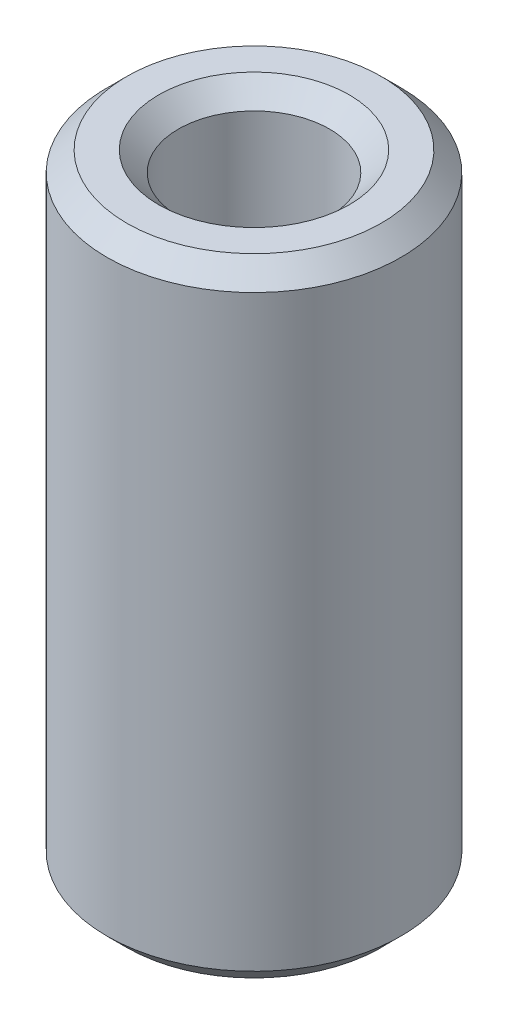
ISO-10303-21;
HEADER;
FILE_DESCRIPTION(('STEP AP214'),'2;1');
FILE_NAME('part.step','',(''),(''),'','','');
FILE_SCHEMA(('AUTOMOTIVE_DESIGN { 1 0 10303 214 1 1 1 1 }'));
ENDSEC;
DATA;
#1=APPLICATION_CONTEXT('core data for automotive mechanical design processes');
#2=APPLICATION_PROTOCOL_DEFINITION('international standard','automotive_design',2000,#1);
#3=PRODUCT_CONTEXT('',#1,'mechanical');
#4=PRODUCT('Part','Part','',(#3));
#5=PRODUCT_RELATED_PRODUCT_CATEGORY('part','',(#4));
#6=PRODUCT_DEFINITION_FORMATION('','',#4);
#7=PRODUCT_DEFINITION_CONTEXT('part definition',#1,'design');
#8=PRODUCT_DEFINITION('design','',#6,#7);
#9=PRODUCT_DEFINITION_SHAPE('','',#8);
#10=(LENGTH_UNIT() NAMED_UNIT(*) SI_UNIT(.MILLI.,.METRE.));
#11=(NAMED_UNIT(*) PLANE_ANGLE_UNIT() SI_UNIT($,.RADIAN.));
#12=(NAMED_UNIT(*) SI_UNIT($,.STERADIAN.) SOLID_ANGLE_UNIT());
#13=UNCERTAINTY_MEASURE_WITH_UNIT(LENGTH_MEASURE(1.E-05),#10,'distance_accuracy_value','');
#14=(GEOMETRIC_REPRESENTATION_CONTEXT(3) GLOBAL_UNCERTAINTY_ASSIGNED_CONTEXT((#13)) GLOBAL_UNIT_ASSIGNED_CONTEXT((#10,
#11,#12)) REPRESENTATION_CONTEXT('',''));
#15=CARTESIAN_POINT('',(0.,0.,0.));
#16=DIRECTION('',(0.,0.,1.));
#17=DIRECTION('',(1.,0.,0.));
#18=AXIS2_PLACEMENT_3D('',#15,#16,#17);
#19=CARTESIAN_POINT('',(0.,42.6871000319356,0.));
#20=DIRECTION('',(0.,-1.,0.));
#21=DIRECTION('',(0.,0.,-1.));
#22=AXIS2_PLACEMENT_3D('',#19,#20,#21);
#23=CYLINDRICAL_SURFACE('',#22,10.);
#24=CARTESIAN_POINT('',(0.,1.34265509033225,0.));
#25=DIRECTION('',(0.,1.,0.));
#26=DIRECTION('',(0.,0.,1.));
#27=AXIS2_PLACEMENT_3D('',#24,#25,#26);
#28=CIRCLE('',#27,10.);
#29=CARTESIAN_POINT('',(0.,1.34265509033225,10.));
#30=VERTEX_POINT('',#29);
#31=EDGE_CURVE('E10',#30,#30,#28,.T.);
#32=ORIENTED_EDGE('',*,*,#31,.T.);
#33=EDGE_LOOP('',(#32));
#34=FACE_BOUND('',#33,.T.);
#35=CARTESIAN_POINT('',(0.,41.3444449416034,0.));
#36=DIRECTION('',(0.,1.,0.));
#37=DIRECTION('',(0.,0.,1.));
#38=AXIS2_PLACEMENT_3D('',#35,#36,#37);
#39=CIRCLE('',#38,10.);
#40=CARTESIAN_POINT('',(0.,41.3444449416034,10.));
#41=VERTEX_POINT('',#40);
#42=EDGE_CURVE('E50',#41,#41,#39,.F.);
#43=ORIENTED_EDGE('',*,*,#42,.T.);
#44=EDGE_LOOP('',(#43));
#45=FACE_BOUND('',#44,.T.);
#46=ADVANCED_FACE('F39',(#34,#45),#23,.T.);
#47=CARTESIAN_POINT('',(0.,42.6871000319356,0.));
#48=DIRECTION('',(0.,1.,0.));
#49=DIRECTION('',(0.,0.,1.));
#50=AXIS2_PLACEMENT_3D('',#47,#48,#49);
#51=PLANE('',#50);
#52=CARTESIAN_POINT('',(0.,42.6871000319356,0.));
#53=DIRECTION('',(0.,1.,0.));
#54=DIRECTION('',(0.,0.,1.));
#55=AXIS2_PLACEMENT_3D('',#52,#53,#54);
#56=CIRCLE('',#55,6.48401903454802);
#57=CARTESIAN_POINT('',(0.,42.6871000319356,6.48401903454802));
#58=VERTEX_POINT('',#57);
#59=EDGE_CURVE('E58',#58,#58,#56,.F.);
#60=ORIENTED_EDGE('',*,*,#59,.T.);
#61=EDGE_LOOP('',(#60));
#62=FACE_BOUND('',#61,.T.);
#63=CARTESIAN_POINT('',(0.,42.6871000319356,0.));
#64=DIRECTION('',(0.,1.,0.));
#65=DIRECTION('',(0.,0.,1.));
#66=AXIS2_PLACEMENT_3D('',#63,#64,#65);
#67=CIRCLE('',#66,8.65734490966775);
#68=CARTESIAN_POINT('',(0.,42.6871000319356,8.65734490966775));
#69=VERTEX_POINT('',#68);
#70=EDGE_CURVE('E61',#69,#69,#67,.T.);
#71=ORIENTED_EDGE('',*,*,#70,.T.);
#72=EDGE_LOOP('',(#71));
#73=FACE_BOUND('',#72,.T.);
#74=ADVANCED_FACE('F88',(#62,#73),#51,.T.);
#75=CARTESIAN_POINT('',(0.,0.,0.));
#76=DIRECTION('',(0.,1.,0.));
#77=DIRECTION('',(0.,0.,1.));
#78=AXIS2_PLACEMENT_3D('',#75,#76,#77);
#79=PLANE('',#78);
#80=CARTESIAN_POINT('',(0.,0.,0.));
#81=DIRECTION('',(0.,1.,0.));
#82=DIRECTION('',(0.,0.,1.));
#83=AXIS2_PLACEMENT_3D('',#80,#81,#82);
#84=CIRCLE('',#83,6.484019034548);
#85=CARTESIAN_POINT('',(0.,0.,6.484019034548));
#86=VERTEX_POINT('',#85);
#87=EDGE_CURVE('E51',#86,#86,#84,.T.);
#88=ORIENTED_EDGE('',*,*,#87,.T.);
#89=EDGE_LOOP('',(#88));
#90=FACE_BOUND('',#89,.T.);
#91=CARTESIAN_POINT('',(0.,0.,0.));
#92=DIRECTION('',(0.,1.,0.));
#93=DIRECTION('',(0.,0.,1.));
#94=AXIS2_PLACEMENT_3D('',#91,#92,#93);
#95=CIRCLE('',#94,8.65734490966774);
#96=CARTESIAN_POINT('',(0.,0.,8.65734490966774));
#97=VERTEX_POINT('',#96);
#98=EDGE_CURVE('E54',#97,#97,#95,.F.);
#99=ORIENTED_EDGE('',*,*,#98,.T.);
#100=EDGE_LOOP('',(#99));
#101=FACE_BOUND('',#100,.T.);
#102=ADVANCED_FACE('F83',(#90,#101),#79,.F.);
#103=CARTESIAN_POINT('',(0.,42.6871000319356,0.));
#104=DIRECTION('',(0.,-1.,0.));
#105=DIRECTION('',(0.,0.,-1.));
#106=AXIS2_PLACEMENT_3D('',#103,#104,#105);
#107=CYLINDRICAL_SURFACE('',#106,5.14136394421576);
#108=CARTESIAN_POINT('',(0.,41.3444449416034,0.));
#109=DIRECTION('',(0.,1.,0.));
#110=DIRECTION('',(0.,0.,1.));
#111=AXIS2_PLACEMENT_3D('',#108,#109,#110);
#112=CIRCLE('',#111,5.14136394421576);
#113=CARTESIAN_POINT('',(0.,41.3444449416034,5.14136394421576));
#114=VERTEX_POINT('',#113);
#115=EDGE_CURVE('E67',#114,#114,#112,.T.);
#116=ORIENTED_EDGE('',*,*,#115,.T.);
#117=EDGE_LOOP('',(#116));
#118=FACE_BOUND('',#117,.T.);
#119=CARTESIAN_POINT('',(0.,1.34265509033226,0.));
#120=DIRECTION('',(0.,1.,0.));
#121=DIRECTION('',(0.,0.,1.));
#122=AXIS2_PLACEMENT_3D('',#119,#120,#121);
#123=CIRCLE('',#122,5.14136394421576);
#124=CARTESIAN_POINT('',(0.,1.34265509033226,5.14136394421576));
#125=VERTEX_POINT('',#124);
#126=EDGE_CURVE('E69',#125,#125,#123,.F.);
#127=ORIENTED_EDGE('',*,*,#126,.T.);
#128=EDGE_LOOP('',(#127));
#129=FACE_BOUND('',#128,.T.);
#130=ADVANCED_FACE('F71',(#118,#129),#107,.F.);
#131=CARTESIAN_POINT('',(0.,41.3444449416034,0.));
#132=DIRECTION('',(0.,1.,0.));
#133=DIRECTION('',(0.,0.,1.));
#134=AXIS2_PLACEMENT_3D('',#131,#132,#133);
#135=CONICAL_SURFACE('',#134,5.14136394421576,0.785398163397454);
#136=ORIENTED_EDGE('',*,*,#59,.F.);
#137=EDGE_LOOP('',(#136));
#138=FACE_BOUND('',#137,.T.);
#139=ORIENTED_EDGE('',*,*,#115,.F.);
#140=EDGE_LOOP('',(#139));
#141=FACE_BOUND('',#140,.T.);
#142=ADVANCED_FACE('F77',(#138,#141),#135,.F.);
#143=CARTESIAN_POINT('',(0.,0.,0.));
#144=DIRECTION('',(0.,-1.,0.));
#145=DIRECTION('',(0.,0.,-1.));
#146=AXIS2_PLACEMENT_3D('',#143,#144,#145);
#147=CONICAL_SURFACE('',#146,6.484019034548,0.785398163397444);
#148=ORIENTED_EDGE('',*,*,#126,.F.);
#149=EDGE_LOOP('',(#148));
#150=FACE_BOUND('',#149,.T.);
#151=ORIENTED_EDGE('',*,*,#87,.F.);
#152=EDGE_LOOP('',(#151));
#153=FACE_BOUND('',#152,.T.);
#154=ADVANCED_FACE('F73',(#150,#153),#147,.F.);
#155=CARTESIAN_POINT('',(0.,1.34265509033225,0.));
#156=DIRECTION('',(0.,1.,0.));
#157=DIRECTION('',(0.,0.,1.));
#158=AXIS2_PLACEMENT_3D('',#155,#156,#157);
#159=CONICAL_SURFACE('',#158,10.,0.785398163397452);
#160=ORIENTED_EDGE('',*,*,#98,.F.);
#161=EDGE_LOOP('',(#160));
#162=FACE_BOUND('',#161,.T.);
#163=ORIENTED_EDGE('',*,*,#31,.F.);
#164=EDGE_LOOP('',(#163));
#165=FACE_BOUND('',#164,.T.);
#166=ADVANCED_FACE('F76',(#162,#165),#159,.T.);
#167=CARTESIAN_POINT('',(0.,42.6871000319356,0.));
#168=DIRECTION('',(0.,-1.,0.));
#169=DIRECTION('',(0.,0.,-1.));
#170=AXIS2_PLACEMENT_3D('',#167,#168,#169);
#171=CONICAL_SURFACE('',#170,8.65734490966775,0.785398163397443);
#172=ORIENTED_EDGE('',*,*,#42,.F.);
#173=EDGE_LOOP('',(#172));
#174=FACE_BOUND('',#173,.T.);
#175=ORIENTED_EDGE('',*,*,#70,.F.);
#176=EDGE_LOOP('',(#175));
#177=FACE_BOUND('',#176,.T.);
#178=ADVANCED_FACE('F45',(#174,#177),#171,.T.);
#179=CLOSED_SHELL('',(#46,#74,#102,#130,#142,#154,#166,#178));
#180=MANIFOLD_SOLID_BREP('B2',#179);
#181=ADVANCED_BREP_SHAPE_REPRESENTATION('',(#18,#180),#14);
#182=SHAPE_DEFINITION_REPRESENTATION(#9,#181);
ENDSEC;
END-ISO-10303-21;
